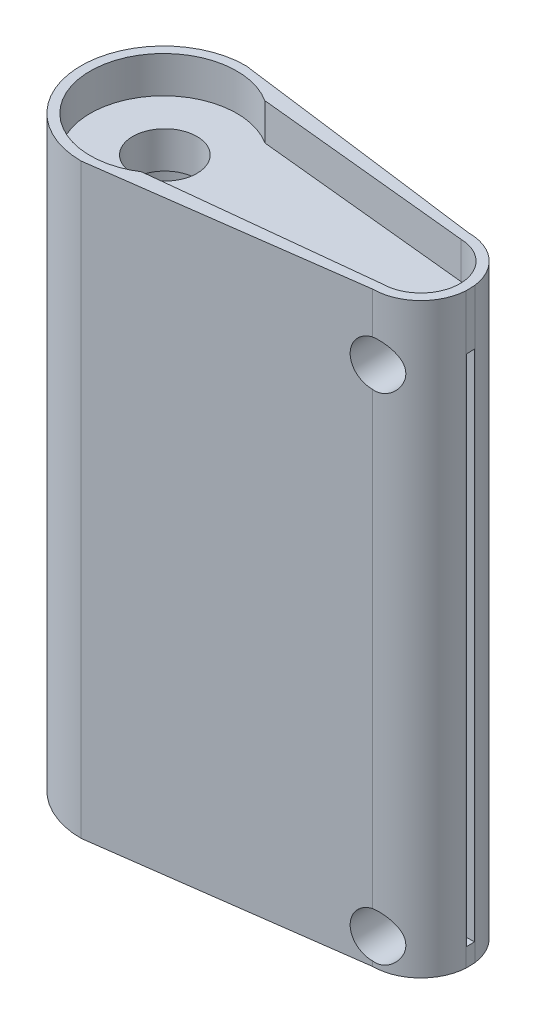
ISO-10303-21;
HEADER;
FILE_DESCRIPTION(('STEP AP214'),'2;1');
FILE_NAME('part.step','',(''),(''),'','','');
FILE_SCHEMA(('AUTOMOTIVE_DESIGN { 1 0 10303 214 1 1 1 1 }'));
ENDSEC;
DATA;
#1=APPLICATION_CONTEXT('core data for automotive mechanical design processes');
#2=APPLICATION_PROTOCOL_DEFINITION('international standard','automotive_design',2000,#1);
#3=PRODUCT_CONTEXT('',#1,'mechanical');
#4=PRODUCT('Part','Part','',(#3));
#5=PRODUCT_RELATED_PRODUCT_CATEGORY('part','',(#4));
#6=PRODUCT_DEFINITION_FORMATION('','',#4);
#7=PRODUCT_DEFINITION_CONTEXT('part definition',#1,'design');
#8=PRODUCT_DEFINITION('design','',#6,#7);
#9=PRODUCT_DEFINITION_SHAPE('','',#8);
#10=(LENGTH_UNIT() NAMED_UNIT(*) SI_UNIT(.MILLI.,.METRE.));
#11=(NAMED_UNIT(*) PLANE_ANGLE_UNIT() SI_UNIT($,.RADIAN.));
#12=(NAMED_UNIT(*) SI_UNIT($,.STERADIAN.) SOLID_ANGLE_UNIT());
#13=UNCERTAINTY_MEASURE_WITH_UNIT(LENGTH_MEASURE(1.E-05),#10,'distance_accuracy_value','');
#14=(GEOMETRIC_REPRESENTATION_CONTEXT(3) GLOBAL_UNCERTAINTY_ASSIGNED_CONTEXT((#13)) GLOBAL_UNIT_ASSIGNED_CONTEXT((#10,
#11,#12)) REPRESENTATION_CONTEXT('',''));
#15=CARTESIAN_POINT('',(0.,0.,0.));
#16=DIRECTION('',(0.,0.,1.));
#17=DIRECTION('',(1.,0.,0.));
#18=AXIS2_PLACEMENT_3D('',#15,#16,#17);
#19=CARTESIAN_POINT('',(-12.9871602464953,32.,0.0358235169116221));
#20=DIRECTION('',(0.,-1.,0.));
#21=DIRECTION('',(0.,0.,-1.));
#22=AXIS2_PLACEMENT_3D('',#19,#20,#21);
#23=CYLINDRICAL_SURFACE('',#22,2.63664714266322);
#24=CARTESIAN_POINT('',(-12.9871602464953,29.75,-2.6008236257516));
#25=CARTESIAN_POINT('',(-12.9536429182694,29.7500016509745,-2.60082700286815));
#26=CARTESIAN_POINT('',(-12.9201440378542,29.7486524852142,-2.600183813309));
#27=CARTESIAN_POINT('',(-12.8534221469592,29.743292727038,-2.59764069467436));
#28=CARTESIAN_POINT('',(-12.8201990228621,29.7392832920886,-2.59574131216172));
#29=CARTESIAN_POINT('',(-12.7216093436019,29.7233797950699,-2.58823932110993));
#30=CARTESIAN_POINT('',(-12.6569604247245,29.7076095651786,-2.58083206617991));
#31=CARTESIAN_POINT('',(-12.5315903290713,29.666468337325,-2.56194306435159));
#32=CARTESIAN_POINT('',(-12.4708641752029,29.6411097964571,-2.55046660534585));
#33=CARTESIAN_POINT('',(-12.3544859230186,29.581675758071,-2.52448714875822));
#34=CARTESIAN_POINT('',(-12.2988391705523,29.5475912170968,-2.50998101417012));
#35=CARTESIAN_POINT('',(-12.1904237204566,29.4692493047555,-2.47823839720175));
#36=CARTESIAN_POINT('',(-12.1380520249355,29.4244894224357,-2.46088795566792));
#37=CARTESIAN_POINT('',(-12.0412539786451,29.3271407394288,-2.42584736966169));
#38=CARTESIAN_POINT('',(-11.9968326567385,29.274547021854,-2.40815701796329));
#39=CARTESIAN_POINT('',(-11.9142840927889,29.1587224927093,-2.37311584238737));
#40=CARTESIAN_POINT('',(-11.8767760831313,29.0950156411206,-2.3558667634034));
#41=CARTESIAN_POINT('',(-11.8133740599787,28.9611776494204,-2.32540093096637));
#42=CARTESIAN_POINT('',(-11.7874694358608,28.8910524494923,-2.31218049710299));
#43=CARTESIAN_POINT('',(-11.7500767473201,28.7517369071863,-2.29268454820715));
#44=CARTESIAN_POINT('',(-11.737666902395,28.6828585516823,-2.28596900858318));
#45=CARTESIAN_POINT('',(-11.7247785826152,28.5436940576085,-2.27899010325594));
#46=CARTESIAN_POINT('',(-11.7242893609858,28.4734092442267,-2.27872092598079));
#47=CARTESIAN_POINT('',(-11.7345831875717,28.3424318956384,-2.28430113946078));
#48=CARTESIAN_POINT('',(-11.7440275609547,28.2815958806547,-2.28942395160812));
#49=CARTESIAN_POINT('',(-11.7716810613146,28.1624954941281,-2.30399710558127));
#50=CARTESIAN_POINT('',(-11.7898927531319,28.1042318805785,-2.31344871373788));
#51=CARTESIAN_POINT('',(-11.8350250767983,27.9898467784687,-2.33591474049053));
#52=CARTESIAN_POINT('',(-11.8621913493797,27.9338425564836,-2.34902783706334));
#53=CARTESIAN_POINT('',(-11.924219313174,27.8268442525601,-2.37731253972362));
#54=CARTESIAN_POINT('',(-11.9590846308119,27.7758525480428,-2.39248511457009));
#55=CARTESIAN_POINT('',(-12.0407389220958,27.6733599216918,-2.42555316379225));
#56=CARTESIAN_POINT('',(-12.0884884633449,27.6226532977567,-2.4435463196136));
#57=CARTESIAN_POINT('',(-12.1918468590331,27.5295523040197,-2.47860749100784));
#58=CARTESIAN_POINT('',(-12.2474604235406,27.4871629523496,-2.49567494360285));
#59=CARTESIAN_POINT('',(-12.368512649667,27.409829012891,-2.52802242908061));
#60=CARTESIAN_POINT('',(-12.4343120042545,27.375386663792,-2.54316321842384));
#61=CARTESIAN_POINT('',(-12.5716361647648,27.3183338544837,-2.56880699286476));
#62=CARTESIAN_POINT('',(-12.6431501810552,27.295701677383,-2.57931848485457));
#63=CARTESIAN_POINT('',(-12.7606238749456,27.2697883627634,-2.59145232177663));
#64=CARTESIAN_POINT('',(-12.8055204727648,27.2623947943366,-2.5949458066474));
#65=CARTESIAN_POINT('',(-12.8959853192472,27.2524940236076,-2.59963966265786));
#66=CARTESIAN_POINT('',(-12.9415538538667,27.2499889659429,-2.60083902734005));
#67=CARTESIAN_POINT('',(-12.9871602464953,27.25,-2.6008236257516));
#68=B_SPLINE_CURVE_WITH_KNOTS('',3,(#24,#25,#26,#27,#28,#29,#30,#31,#32,#33,#34,#35,#36,#37,#38,
#39,#40,#41,#42,#43,#44,#45,#46,#47,#48,#49,#50,#51,#52,#53,#54,#55,#56,#57,#58,#59,#60,#61,#62,
#63,#64,#65,#66,#67),.UNSPECIFIED.,.F.,.F.,(4,2,2,2,2,2,2,2,2,2,2,2,2,2,2,2,2,2,2,2,2,4),(0.,
0.100483374050645,0.200923057058032,0.400731245594896,0.600280731174771,0.800037869107766,
1.01227482136819,1.22464554938224,1.45121252624221,1.67757189565538,1.88724887982661,
2.0967368273421,2.28121679021164,2.46575075470702,2.65583923061658,2.84601743422461,
3.06089994616391,3.27591170903882,3.50211297352299,3.72789681359177,3.86450282961939,
4.00116876257929),.UNSPECIFIED.);
#69=CARTESIAN_POINT('',(-12.9871602464953,29.75,-2.6008236257516));
#70=VERTEX_POINT('',#69);
#71=CARTESIAN_POINT('',(-12.9871602464953,27.25,-2.6008236257516));
#72=VERTEX_POINT('',#71);
#73=EDGE_CURVE('E77',#70,#72,#68,.T.);
#74=ORIENTED_EDGE('',*,*,#73,.F.);
#75=DIRECTION('',(0.,-1.,0.));
#76=VECTOR('',#75,1.);
#77=CARTESIAN_POINT('',(-12.9871602464953,32.,-2.6008236257516));
#78=LINE('',#77,#76);
#79=CARTESIAN_POINT('',(-12.9871602464953,32.,-2.6008236257516));
#80=VERTEX_POINT('',#79);
#81=EDGE_CURVE('E335',#80,#70,#78,.T.);
#82=ORIENTED_EDGE('',*,*,#81,.F.);
#83=CARTESIAN_POINT('',(-12.9871602464953,32.,0.0358235169116221));
#84=DIRECTION('',(0.,1.,0.));
#85=DIRECTION('',(0.,0.,1.));
#86=AXIS2_PLACEMENT_3D('',#83,#84,#85);
#87=CIRCLE('',#86,2.63664714266322);
#88=CARTESIAN_POINT('',(-10.3719870743321,32.,-0.300000000001854));
#89=VERTEX_POINT('',#88);
#90=EDGE_CURVE('E276',#89,#80,#87,.T.);
#91=ORIENTED_EDGE('',*,*,#90,.F.);
#92=DIRECTION('',(0.,-1.,0.));
#93=VECTOR('',#92,1.);
#94=CARTESIAN_POINT('',(-10.3719870743321,32.,-0.300000000001854));
#95=LINE('',#94,#93);
#96=CARTESIAN_POINT('',(-10.3719870743321,0.,-0.300000000001854));
#97=VERTEX_POINT('',#96);
#98=EDGE_CURVE('E314',#89,#97,#95,.T.);
#99=ORIENTED_EDGE('',*,*,#98,.T.);
#100=CARTESIAN_POINT('',(-12.9871602464953,0.,0.0358235169116221));
#101=DIRECTION('',(0.,1.,0.));
#102=DIRECTION('',(0.,0.,1.));
#103=AXIS2_PLACEMENT_3D('',#100,#101,#102);
#104=CIRCLE('',#103,2.63664714266322);
#105=CARTESIAN_POINT('',(-12.9871602464953,0.,-2.6008236257516));
#106=VERTEX_POINT('',#105);
#107=EDGE_CURVE('E295',#97,#106,#104,.T.);
#108=ORIENTED_EDGE('',*,*,#107,.T.);
#109=CARTESIAN_POINT('',(-12.9871602464953,0.25,-2.6008236257516));
#110=VERTEX_POINT('',#109);
#111=EDGE_CURVE('E334',#110,#106,#78,.T.);
#112=ORIENTED_EDGE('',*,*,#111,.F.);
#113=CARTESIAN_POINT('',(-12.9871602464953,2.75,-2.6008236257516));
#114=CARTESIAN_POINT('',(-12.9536429182694,2.75000165097446,-2.60082700286815));
#115=CARTESIAN_POINT('',(-12.9201440378542,2.7486524852142,-2.600183813309));
#116=CARTESIAN_POINT('',(-12.8534221469592,2.74329272703803,-2.59764069467436));
#117=CARTESIAN_POINT('',(-12.8201990228621,2.73928329208861,-2.59574131216172));
#118=CARTESIAN_POINT('',(-12.7216093436019,2.72337979506986,-2.58823932110993));
#119=CARTESIAN_POINT('',(-12.6569604247245,2.70760956517856,-2.58083206617991));
#120=CARTESIAN_POINT('',(-12.5315903290713,2.66646833732504,-2.56194306435159));
#121=CARTESIAN_POINT('',(-12.4708641752029,2.6411097964571,-2.55046660534585));
#122=CARTESIAN_POINT('',(-12.3544859230186,2.58167575807096,-2.52448714875822));
#123=CARTESIAN_POINT('',(-12.2988391705523,2.54759121709681,-2.50998101417012));
#124=CARTESIAN_POINT('',(-12.1904237204566,2.46924930475551,-2.47823839720176));
#125=CARTESIAN_POINT('',(-12.1380520249355,2.42448942243572,-2.46088795566792));
#126=CARTESIAN_POINT('',(-12.0412539786451,2.32714073942883,-2.42584736966169));
#127=CARTESIAN_POINT('',(-11.9968326567385,2.27454702185398,-2.40815701796329));
#128=CARTESIAN_POINT('',(-11.9142840927889,2.1587224927093,-2.37311584238737));
#129=CARTESIAN_POINT('',(-11.8767760831313,2.0950156411206,-2.3558667634034));
#130=CARTESIAN_POINT('',(-11.8133740599787,1.96117764942043,-2.32540093096637));
#131=CARTESIAN_POINT('',(-11.7874694358608,1.89105244949229,-2.31218049710299));
#132=CARTESIAN_POINT('',(-11.7500767473201,1.75173690718627,-2.29268454820715));
#133=CARTESIAN_POINT('',(-11.737666902395,1.68285855168228,-2.28596900858318));
#134=CARTESIAN_POINT('',(-11.7247785826152,1.54369405760852,-2.27899010325594));
#135=CARTESIAN_POINT('',(-11.7242893609858,1.47340924422668,-2.27872092598079));
#136=CARTESIAN_POINT('',(-11.7345831875717,1.3424318956384,-2.28430113946079));
#137=CARTESIAN_POINT('',(-11.7440275609547,1.28159588065472,-2.28942395160812));
#138=CARTESIAN_POINT('',(-11.7716810613146,1.16249549412808,-2.30399710558127));
#139=CARTESIAN_POINT('',(-11.7898927531319,1.10423188057851,-2.31344871373789));
#140=CARTESIAN_POINT('',(-11.8350250767983,0.989846778468667,-2.33591474049053));
#141=CARTESIAN_POINT('',(-11.8621913493797,0.933842556483624,-2.34902783706335));
#142=CARTESIAN_POINT('',(-11.924219313174,0.826844252560114,-2.37731253972362));
#143=CARTESIAN_POINT('',(-11.9590846308119,0.77585254804275,-2.3924851145701));
#144=CARTESIAN_POINT('',(-12.0407389220958,0.673359921691824,-2.42555316379225));
#145=CARTESIAN_POINT('',(-12.088488463345,0.622653297756652,-2.4435463196136));
#146=CARTESIAN_POINT('',(-12.1918468590331,0.52955230401966,-2.47860749100784));
#147=CARTESIAN_POINT('',(-12.2474604235406,0.487162952349585,-2.49567494360286));
#148=CARTESIAN_POINT('',(-12.368512649667,0.409829012891001,-2.52802242908061));
#149=CARTESIAN_POINT('',(-12.4343120042545,0.375386663791952,-2.54316321842384));
#150=CARTESIAN_POINT('',(-12.5716361647648,0.318333854483672,-2.56880699286476));
#151=CARTESIAN_POINT('',(-12.6431501810552,0.295701677382958,-2.57931848485457));
#152=CARTESIAN_POINT('',(-12.7606238749456,0.269788362763451,-2.59145232177663));
#153=CARTESIAN_POINT('',(-12.8055204727648,0.262394794336616,-2.5949458066474));
#154=CARTESIAN_POINT('',(-12.8959853192472,0.252494023607655,-2.59963966265786));
#155=CARTESIAN_POINT('',(-12.9415538538667,0.249988965942941,-2.60083902734005));
#156=CARTESIAN_POINT('',(-12.9871602464953,0.250000000000002,-2.6008236257516));
#157=B_SPLINE_CURVE_WITH_KNOTS('',3,(#113,#114,#115,#116,#117,#118,#119,#120,#121,#122,#123,
#124,#125,#126,#127,#128,#129,#130,#131,#132,#133,#134,#135,#136,#137,#138,#139,#140,#141,#142,
#143,#144,#145,#146,#147,#148,#149,#150,#151,#152,#153,#154,#155,#156),.UNSPECIFIED.,.F.,.F.,(4,
2,2,2,2,2,2,2,2,2,2,2,2,2,2,2,2,2,2,2,2,4),(0.,0.100483374050643,0.200923057058032,
0.400731245594897,0.600280731174771,0.800037869107767,1.01227482136819,1.22464554938224,
1.45121252624221,1.67757189565538,1.88724887982661,2.09673682734209,2.28121679021164,
2.46575075470702,2.65583923061658,2.84601743422462,3.06089994616391,3.27591170903883,
3.50211297352298,3.72789681359177,3.86450282961938,4.00116876257927),.UNSPECIFIED.);
#158=CARTESIAN_POINT('',(-12.9871602464953,2.75,-2.6008236257516));
#159=VERTEX_POINT('',#158);
#160=EDGE_CURVE('E70',#159,#110,#157,.T.);
#161=ORIENTED_EDGE('',*,*,#160,.F.);
#162=EDGE_CURVE('E340',#72,#159,#78,.T.);
#163=ORIENTED_EDGE('',*,*,#162,.F.);
#164=EDGE_LOOP('',(#74,#82,#91,#99,#108,#112,#161,#163));
#165=FACE_BOUND('',#164,.T.);
#166=ADVANCED_FACE('F54',(#165),#23,.T.);
#167=CARTESIAN_POINT('',(-23.3495000105712,29.,0.599950037503474));
#168=DIRECTION('',(0.,1.,0.));
#169=DIRECTION('',(0.,0.,1.));
#170=AXIS2_PLACEMENT_3D('',#167,#168,#169);
#171=PLANE('',#170);
#172=DIRECTION('',(0.0326977190779221,0.,0.999465286624354));
#173=VECTOR('',#172,1.);
#174=CARTESIAN_POINT('',(-14.211689062653,29.,-4.9933489360173));
#175=LINE('',#174,#173);
#176=CARTESIAN_POINT('',(-14.038668343629,29.,0.295344202461677));
#177=VERTEX_POINT('',#176);
#178=CARTESIAN_POINT('',(-14.053382317214,29.,-0.154415176519281));
#179=VERTEX_POINT('',#178);
#180=EDGE_CURVE('E203',#177,#179,#175,.F.);
#181=ORIENTED_EDGE('',*,*,#180,.F.);
#182=DIRECTION('',(0.999465286624354,0.,-0.0326977190779221));
#183=VECTOR('',#182,1.);
#184=CARTESIAN_POINT('',(-23.3495000105712,29.,0.599950037503474));
#185=LINE('',#184,#183);
#186=CARTESIAN_POINT('',(-23.3495000105712,29.,0.599950037503474));
#187=VERTEX_POINT('',#186);
#188=EDGE_CURVE('E208',#187,#177,#185,.T.);
#189=ORIENTED_EDGE('',*,*,#188,.F.);
#190=DIRECTION('',(0.0326977190779212,0.,0.999465286624354));
#191=VECTOR('',#190,1.);
#192=CARTESIAN_POINT('',(-23.3495000105712,29.,0.599950037503474));
#193=LINE('',#192,#191);
#194=CARTESIAN_POINT('',(-23.3642139841563,29.,0.150190658522515));
#195=VERTEX_POINT('',#194);
#196=EDGE_CURVE('E696',#195,#187,#193,.T.);
#197=ORIENTED_EDGE('',*,*,#196,.F.);
#198=DIRECTION('',(0.999465286624354,0.,-0.0326977190779221));
#199=VECTOR('',#198,1.);
#200=CARTESIAN_POINT('',(-23.3642139841563,29.,0.150190658522515));
#201=LINE('',#200,#199);
#202=EDGE_CURVE('E210',#195,#179,#201,.T.);
#203=ORIENTED_EDGE('',*,*,#202,.T.);
#204=EDGE_LOOP('',(#181,#189,#197,#203));
#205=FACE_BOUND('',#204,.T.);
#206=ADVANCED_FACE('F205',(#205),#171,.F.);
#207=DIRECTION('',(0.0326977190779221,0.,0.999465286624354));
#208=VECTOR('',#207,1.);
#209=CARTESIAN_POINT('',(-11.9216263974346,29.,-5.06826882238079));
#210=LINE('',#209,#208);
#211=CARTESIAN_POINT('',(-11.7633196519956,29.,-0.229335062882771));
#212=VERTEX_POINT('',#211);
#213=CARTESIAN_POINT('',(-11.7486056784105,29.,0.220424316098187));
#214=VERTEX_POINT('',#213);
#215=EDGE_CURVE('E215',#212,#214,#210,.T.);
#216=ORIENTED_EDGE('',*,*,#215,.F.);
#217=CARTESIAN_POINT('',(-10.3711652580397,29.,-0.274879689490473));
#218=VERTEX_POINT('',#217);
#219=EDGE_CURVE('E247',#212,#218,#201,.T.);
#220=ORIENTED_EDGE('',*,*,#219,.T.);
#221=DIRECTION('',(0.0326977190779212,0.,0.999465286624354));
#222=VECTOR('',#221,1.);
#223=CARTESIAN_POINT('',(-10.3564512844547,29.,0.174879689490487));
#224=LINE('',#223,#222);
#225=CARTESIAN_POINT('',(-10.3564512844547,29.,0.174879689490487));
#226=VERTEX_POINT('',#225);
#227=EDGE_CURVE('E243',#218,#226,#224,.T.);
#228=ORIENTED_EDGE('',*,*,#227,.T.);
#229=EDGE_CURVE('E234',#214,#226,#185,.T.);
#230=ORIENTED_EDGE('',*,*,#229,.F.);
#231=EDGE_LOOP('',(#216,#220,#228,#230));
#232=FACE_BOUND('',#231,.T.);
#233=ADVANCED_FACE('F406',(#232),#171,.F.);
#234=CARTESIAN_POINT('',(-23.3642139841563,1.,0.150190658522512));
#235=DIRECTION('',(0.,-1.,0.));
#236=DIRECTION('',(0.,0.,-1.));
#237=AXIS2_PLACEMENT_3D('',#234,#235,#236);
#238=PLANE('',#237);
#239=DIRECTION('',(0.0326977190779221,0.,0.999465286624354));
#240=VECTOR('',#239,1.);
#241=CARTESIAN_POINT('',(-11.9216263974346,1.,-5.0682688223808));
#242=LINE('',#241,#240);
#243=CARTESIAN_POINT('',(-11.7486056784105,1.,0.220424316098184));
#244=VERTEX_POINT('',#243);
#245=CARTESIAN_POINT('',(-11.7633196519956,1.,-0.229335062882775));
#246=VERTEX_POINT('',#245);
#247=EDGE_CURVE('E724',#244,#246,#242,.F.);
#248=ORIENTED_EDGE('',*,*,#247,.F.);
#249=DIRECTION('',(0.999465286624354,0.,-0.0326977190779221));
#250=VECTOR('',#249,1.);
#251=CARTESIAN_POINT('',(-23.3495000105712,1.,0.599950037503471));
#252=LINE('',#251,#250);
#253=CARTESIAN_POINT('',(-10.3564512844547,0.999999999999997,0.174879689490384));
#254=VERTEX_POINT('',#253);
#255=EDGE_CURVE('E257',#244,#254,#252,.T.);
#256=ORIENTED_EDGE('',*,*,#255,.T.);
#257=DIRECTION('',(-0.032697719077925,0.,-0.999465286624353));
#258=VECTOR('',#257,1.);
#259=CARTESIAN_POINT('',(-10.3711652580397,1.,-0.274879689490476));
#260=LINE('',#259,#258);
#261=CARTESIAN_POINT('',(-10.3711652580397,1.,-0.274879689490476));
#262=VERTEX_POINT('',#261);
#263=EDGE_CURVE('E702',#254,#262,#260,.T.);
#264=ORIENTED_EDGE('',*,*,#263,.T.);
#265=DIRECTION('',(0.999465286624354,0.,-0.0326977190779221));
#266=VECTOR('',#265,1.);
#267=CARTESIAN_POINT('',(-23.3642139841563,1.,0.150190658522512));
#268=LINE('',#267,#266);
#269=EDGE_CURVE('E252',#246,#262,#268,.T.);
#270=ORIENTED_EDGE('',*,*,#269,.F.);
#271=EDGE_LOOP('',(#248,#256,#264,#270));
#272=FACE_BOUND('',#271,.T.);
#273=ADVANCED_FACE('F588',(#272),#238,.F.);
#274=DIRECTION('',(0.0326977190779221,0.,0.999465286624354));
#275=VECTOR('',#274,1.);
#276=CARTESIAN_POINT('',(-14.211689062653,1.,-4.99334893601731));
#277=LINE('',#276,#275);
#278=CARTESIAN_POINT('',(-14.053382317214,1.,-0.154415176519285));
#279=VERTEX_POINT('',#278);
#280=CARTESIAN_POINT('',(-14.038668343629,1.,0.295344202461674));
#281=VERTEX_POINT('',#280);
#282=EDGE_CURVE('E730',#279,#281,#277,.T.);
#283=ORIENTED_EDGE('',*,*,#282,.F.);
#284=CARTESIAN_POINT('',(-23.3642139841563,1.,0.150190658522512));
#285=VERTEX_POINT('',#284);
#286=EDGE_CURVE('E248',#285,#279,#268,.T.);
#287=ORIENTED_EDGE('',*,*,#286,.F.);
#288=DIRECTION('',(-0.032697719077925,0.,-0.999465286624353));
#289=VECTOR('',#288,1.);
#290=CARTESIAN_POINT('',(-23.3642139841563,1.,0.150190658522512));
#291=LINE('',#290,#289);
#292=CARTESIAN_POINT('',(-23.3495000105712,1.,0.599950037503471));
#293=VERTEX_POINT('',#292);
#294=EDGE_CURVE('E688',#293,#285,#291,.T.);
#295=ORIENTED_EDGE('',*,*,#294,.F.);
#296=EDGE_CURVE('E253',#293,#281,#252,.T.);
#297=ORIENTED_EDGE('',*,*,#296,.T.);
#298=EDGE_LOOP('',(#283,#287,#295,#297));
#299=FACE_BOUND('',#298,.T.);
#300=ADVANCED_FACE('F504',(#299),#238,.F.);
#301=CARTESIAN_POINT('',(-26.9871144134073,30.,0.));
#302=DIRECTION('',(0.,-1.,0.));
#303=DIRECTION('',(0.,0.,-1.));
#304=AXIS2_PLACEMENT_3D('',#301,#302,#303);
#305=CYLINDRICAL_SURFACE('',#304,1.75);
#306=CARTESIAN_POINT('',(-26.9871144134073,30.,0.));
#307=DIRECTION('',(0.,1.,0.));
#308=DIRECTION('',(0.,0.,1.));
#309=AXIS2_PLACEMENT_3D('',#306,#307,#308);
#310=CIRCLE('',#309,1.75);
#311=CARTESIAN_POINT('',(-26.9871144134073,30.,1.75));
#312=VERTEX_POINT('',#311);
#313=EDGE_CURVE('E339',#312,#312,#310,.T.);
#314=ORIENTED_EDGE('',*,*,#313,.T.);
#315=EDGE_LOOP('',(#314));
#316=FACE_BOUND('',#315,.T.);
#317=CARTESIAN_POINT('',(-26.9871144134073,28.,0.));
#318=DIRECTION('',(0.,-1.,0.));
#319=DIRECTION('',(0.,0.,-1.));
#320=AXIS2_PLACEMENT_3D('',#317,#318,#319);
#321=CIRCLE('',#320,1.75);
#322=CARTESIAN_POINT('',(-26.9871144134073,28.,-1.75));
#323=VERTEX_POINT('',#322);
#324=EDGE_CURVE('E58',#323,#323,#321,.T.);
#325=ORIENTED_EDGE('',*,*,#324,.T.);
#326=EDGE_LOOP('',(#325));
#327=FACE_BOUND('',#326,.T.);
#328=ADVANCED_FACE('F56',(#316,#327),#305,.F.);
#329=CARTESIAN_POINT('',(0.,30.,0.));
#330=DIRECTION('',(0.,1.,0.));
#331=DIRECTION('',(0.,0.,1.));
#332=AXIS2_PLACEMENT_3D('',#329,#330,#331);
#333=PLANE('',#332);
#334=ORIENTED_EDGE('',*,*,#313,.F.);
#335=EDGE_LOOP('',(#334));
#336=FACE_BOUND('',#335,.T.);
#337=CARTESIAN_POINT('',(-26.9871144111105,30.,0.0716479314063977));
#338=DIRECTION('',(0.,1.,0.));
#339=DIRECTION('',(0.,0.,1.));
#340=AXIS2_PLACEMENT_3D('',#337,#338,#339);
#341=CIRCLE('',#340,4.00017684495756);
#342=CARTESIAN_POINT('',(-24.8217817734605,30.,-3.29179514961377));
#343=VERTEX_POINT('',#342);
#344=CARTESIAN_POINT('',(-24.8217479106025,30.,3.43506921180117));
#345=VERTEX_POINT('',#344);
#346=EDGE_CURVE('E357',#343,#345,#341,.T.);
#347=ORIENTED_EDGE('',*,*,#346,.T.);
#348=DIRECTION('',(-0.994303481764952,0.,0.10658605044796));
#349=VECTOR('',#348,1.);
#350=CARTESIAN_POINT('',(0.0820551859234197,30.,0.765463742371819));
#351=LINE('',#350,#349);
#352=CARTESIAN_POINT('',(-12.9871602464953,30.,2.16644048734145));
#353=VERTEX_POINT('',#352);
#354=EDGE_CURVE('E361',#353,#345,#351,.T.);
#355=ORIENTED_EDGE('',*,*,#354,.F.);
#356=CARTESIAN_POINT('',(-12.9871602464953,30.,0.0358235169116221));
#357=DIRECTION('',(0.,1.,0.));
#358=DIRECTION('',(0.,0.,1.));
#359=AXIS2_PLACEMENT_3D('',#356,#357,#358);
#360=CIRCLE('',#359,2.13061697043081);
#361=CARTESIAN_POINT('',(-12.9397621783685,30.,-2.09426617552422));
#362=VERTEX_POINT('',#361);
#363=EDGE_CURVE('E64',#353,#362,#360,.T.);
#364=ORIENTED_EDGE('',*,*,#363,.T.);
#365=DIRECTION('',(0.994959561797014,0.,0.100276968386042));
#366=VECTOR('',#365,1.);
#367=CARTESIAN_POINT('',(0.0788327420462111,30.,-0.782187492741088));
#368=LINE('',#367,#366);
#369=EDGE_CURVE('E12',#343,#362,#368,.T.);
#370=ORIENTED_EDGE('',*,*,#369,.F.);
#371=EDGE_LOOP('',(#347,#355,#364,#370));
#372=FACE_BOUND('',#371,.T.);
#373=ADVANCED_FACE('F370',(#336,#372),#333,.T.);
#374=CARTESIAN_POINT('',(0.,0.,0.));
#375=DIRECTION('',(0.,1.,0.));
#376=DIRECTION('',(0.,0.,1.));
#377=AXIS2_PLACEMENT_3D('',#374,#375,#376);
#378=PLANE('',#377);
#379=CARTESIAN_POINT('',(-26.9871144134073,0.,0.));
#380=DIRECTION('',(0.,-1.,0.));
#381=DIRECTION('',(0.,0.,-1.));
#382=AXIS2_PLACEMENT_3D('',#379,#380,#381);
#383=CIRCLE('',#382,3.);
#384=CARTESIAN_POINT('',(-26.9871144134073,0.,-3.));
#385=VERTEX_POINT('',#384);
#386=EDGE_CURVE('E233',#385,#385,#383,.T.);
#387=ORIENTED_EDGE('',*,*,#386,.F.);
#388=EDGE_LOOP('',(#387));
#389=FACE_BOUND('',#388,.T.);
#390=ORIENTED_EDGE('',*,*,#107,.F.);
#391=DIRECTION('',(0.0326977190779221,0.,0.999465286624354));
#392=VECTOR('',#391,1.);
#393=CARTESIAN_POINT('',(-10.3510938888815,0.,0.338638234521349));
#394=LINE('',#393,#392);
#395=CARTESIAN_POINT('',(-10.3556294681622,0.,0.200000000001868));
#396=VERTEX_POINT('',#395);
#397=EDGE_CURVE('E265',#97,#396,#394,.T.);
#398=ORIENTED_EDGE('',*,*,#397,.T.);
#399=CARTESIAN_POINT('',(-12.9871602464953,0.,2.67247065957485));
#400=VERTEX_POINT('',#399);
#401=EDGE_CURVE('E300',#400,#396,#104,.T.);
#402=ORIENTED_EDGE('',*,*,#401,.F.);
#403=DIRECTION('',(0.990925381502443,0.,-0.134413125453722));
#404=VECTOR('',#403,1.);
#405=CARTESIAN_POINT('',(0.121317820304093,0.,0.894383691786624));
#406=LINE('',#405,#404);
#407=CARTESIAN_POINT('',(-26.9871144111105,0.,4.5714810498644));
#408=VERTEX_POINT('',#407);
#409=EDGE_CURVE('E307',#408,#400,#406,.T.);
#410=ORIENTED_EDGE('',*,*,#409,.F.);
#411=CARTESIAN_POINT('',(-26.9871144111105,0.,0.0716479314063977));
#412=DIRECTION('',(0.,1.,0.));
#413=DIRECTION('',(0.,0.,1.));
#414=AXIS2_PLACEMENT_3D('',#411,#412,#413);
#415=CIRCLE('',#414,4.499833118458);
#416=CARTESIAN_POINT('',(-26.9871144111105,0.,-4.4281851870516));
#417=VERTEX_POINT('',#416);
#418=EDGE_CURVE('E304',#417,#408,#415,.T.);
#419=ORIENTED_EDGE('',*,*,#418,.F.);
#420=DIRECTION('',(0.991588774499467,0.,0.129428367395423));
#421=VECTOR('',#420,1.);
#422=CARTESIAN_POINT('',(0.116231924045835,0.,-0.890486942249725));
#423=LINE('',#422,#421);
#424=EDGE_CURVE('E299',#417,#106,#423,.T.);
#425=ORIENTED_EDGE('',*,*,#424,.T.);
#426=EDGE_LOOP('',(#390,#398,#402,#410,#419,#425));
#427=FACE_BOUND('',#426,.T.);
#428=ADVANCED_FACE('F440',(#389,#427),#378,.F.);
#429=CARTESIAN_POINT('',(0.116231924045835,32.,-0.890486942249725));
#430=DIRECTION('',(0.129428367395423,0.,-0.991588774499467));
#431=DIRECTION('',(-0.991588774499467,0.,-0.129428367395423));
#432=AXIS2_PLACEMENT_3D('',#429,#430,#431);
#433=PLANE('',#432);
#434=ORIENTED_EDGE('',*,*,#81,.T.);
#435=CARTESIAN_POINT('',(-12.9871602464953,28.5,-2.6008236257516));
#436=DIRECTION('',(0.129428367395423,0.,-0.991588774499467));
#437=DIRECTION('',(0.991588774499467,0.,0.129428367395423));
#438=AXIS2_PLACEMENT_3D('',#435,#436,#437);
#439=ELLIPSE('',#438,1.26668663774845,1.25);
#440=EDGE_CURVE('E214',#70,#72,#439,.F.);
#441=ORIENTED_EDGE('',*,*,#440,.T.);
#442=ORIENTED_EDGE('',*,*,#162,.T.);
#443=CARTESIAN_POINT('',(-12.9871602464953,1.5,-2.6008236257516));
#444=DIRECTION('',(0.129428367395423,0.,-0.991588774499467));
#445=DIRECTION('',(0.991588774499467,0.,0.129428367395423));
#446=AXIS2_PLACEMENT_3D('',#443,#444,#445);
#447=ELLIPSE('',#446,1.26668663774845,1.25);
#448=EDGE_CURVE('E726',#159,#110,#447,.F.);
#449=ORIENTED_EDGE('',*,*,#448,.T.);
#450=ORIENTED_EDGE('',*,*,#111,.T.);
#451=ORIENTED_EDGE('',*,*,#424,.F.);
#452=DIRECTION('',(0.,-1.,0.));
#453=VECTOR('',#452,1.);
#454=CARTESIAN_POINT('',(-26.9871144111105,32.,-4.4281851870516));
#455=LINE('',#454,#453);
#456=CARTESIAN_POINT('',(-26.9871144111105,32.,-4.4281851870516));
#457=VERTEX_POINT('',#456);
#458=EDGE_CURVE('E331',#457,#417,#455,.T.);
#459=ORIENTED_EDGE('',*,*,#458,.F.);
#460=DIRECTION('',(0.991588774499467,0.,0.129428367395423));
#461=VECTOR('',#460,1.);
#462=CARTESIAN_POINT('',(0.116231924045835,32.,-0.890486942249725));
#463=LINE('',#462,#461);
#464=EDGE_CURVE('E279',#457,#80,#463,.T.);
#465=ORIENTED_EDGE('',*,*,#464,.T.);
#466=EDGE_LOOP('',(#434,#441,#442,#449,#450,#451,#459,#465));
#467=FACE_BOUND('',#466,.T.);
#468=ADVANCED_FACE('F461',(#467),#433,.T.);
#469=CARTESIAN_POINT('',(-26.9871144111105,32.,0.0716479314063977));
#470=DIRECTION('',(0.,-1.,0.));
#471=DIRECTION('',(0.,0.,-1.));
#472=AXIS2_PLACEMENT_3D('',#469,#470,#471);
#473=CYLINDRICAL_SURFACE('',#472,4.499833118458);
#474=ORIENTED_EDGE('',*,*,#418,.T.);
#475=DIRECTION('',(0.,-1.,0.));
#476=VECTOR('',#475,1.);
#477=CARTESIAN_POINT('',(-26.9871144111105,32.,4.5714810498644));
#478=LINE('',#477,#476);
#479=CARTESIAN_POINT('',(-26.9871144111105,32.,4.5714810498644));
#480=VERTEX_POINT('',#479);
#481=EDGE_CURVE('E326',#480,#408,#478,.T.);
#482=ORIENTED_EDGE('',*,*,#481,.F.);
#483=CARTESIAN_POINT('',(-26.9871144111105,32.,0.0716479314063977));
#484=DIRECTION('',(0.,1.,0.));
#485=DIRECTION('',(0.,0.,1.));
#486=AXIS2_PLACEMENT_3D('',#483,#484,#485);
#487=CIRCLE('',#486,4.499833118458);
#488=EDGE_CURVE('E284',#457,#480,#487,.T.);
#489=ORIENTED_EDGE('',*,*,#488,.F.);
#490=ORIENTED_EDGE('',*,*,#458,.T.);
#491=EDGE_LOOP('',(#474,#482,#489,#490));
#492=FACE_BOUND('',#491,.T.);
#493=ADVANCED_FACE('F418',(#492),#473,.T.);
#494=CARTESIAN_POINT('',(0.121317820304093,32.,0.894383691786624));
#495=DIRECTION('',(-0.134413125453722,0.,-0.990925381502443));
#496=DIRECTION('',(-0.990925381502443,0.,0.134413125453722));
#497=AXIS2_PLACEMENT_3D('',#494,#495,#496);
#498=PLANE('',#497);
#499=DIRECTION('',(0.,-1.,0.));
#500=VECTOR('',#499,1.);
#501=CARTESIAN_POINT('',(-12.9871602464953,32.,2.67247065957485));
#502=LINE('',#501,#500);
#503=CARTESIAN_POINT('',(-12.9871602464953,0.261949223779536,2.67247065957485));
#504=VERTEX_POINT('',#503);
#505=EDGE_CURVE('E321',#504,#400,#502,.T.);
#506=ORIENTED_EDGE('',*,*,#505,.F.);
#507=CARTESIAN_POINT('',(-12.8154054872093,1.5,2.64917314955227));
#508=DIRECTION('',(-0.134413125453722,0.,-0.990925381502443));
#509=DIRECTION('',(0.990925381502443,0.,-0.134413125453722));
#510=AXIS2_PLACEMENT_3D('',#507,#508,#509);
#511=ELLIPSE('',#510,1.25654594713167,1.25);
#512=CARTESIAN_POINT('',(-12.9871602464953,2.73805077622045,2.67247065957485));
#513=VERTEX_POINT('',#512);
#514=EDGE_CURVE('E681',#504,#513,#511,.T.);
#515=ORIENTED_EDGE('',*,*,#514,.T.);
#516=CARTESIAN_POINT('',(-12.9871602464953,27.2619492237795,2.67247065957485));
#517=VERTEX_POINT('',#516);
#518=EDGE_CURVE('E327',#517,#513,#502,.T.);
#519=ORIENTED_EDGE('',*,*,#518,.F.);
#520=CARTESIAN_POINT('',(-12.8154054872093,28.5,2.64917314955227));
#521=DIRECTION('',(-0.134413125453722,0.,-0.990925381502443));
#522=DIRECTION('',(0.990925381502443,0.,-0.134413125453722));
#523=AXIS2_PLACEMENT_3D('',#520,#521,#522);
#524=ELLIPSE('',#523,1.25654594713167,1.25);
#525=CARTESIAN_POINT('',(-12.9871602464953,29.7380507762205,2.67247065957485));
#526=VERTEX_POINT('',#525);
#527=EDGE_CURVE('E680',#517,#526,#524,.T.);
#528=ORIENTED_EDGE('',*,*,#527,.T.);
#529=CARTESIAN_POINT('',(-12.9871602464953,32.,2.67247065957485));
#530=VERTEX_POINT('',#529);
#531=EDGE_CURVE('E322',#530,#526,#502,.T.);
#532=ORIENTED_EDGE('',*,*,#531,.F.);
#533=DIRECTION('',(0.990925381502443,0.,-0.134413125453722));
#534=VECTOR('',#533,1.);
#535=CARTESIAN_POINT('',(0.121317820304093,32.,0.894383691786624));
#536=LINE('',#535,#534);
#537=EDGE_CURVE('E287',#480,#530,#536,.T.);
#538=ORIENTED_EDGE('',*,*,#537,.F.);
#539=ORIENTED_EDGE('',*,*,#481,.T.);
#540=ORIENTED_EDGE('',*,*,#409,.T.);
#541=EDGE_LOOP('',(#506,#515,#519,#528,#532,#538,#539,#540));
#542=FACE_BOUND('',#541,.T.);
#543=ADVANCED_FACE('F411',(#542),#498,.F.);
#544=ORIENTED_EDGE('',*,*,#518,.T.);
#545=CARTESIAN_POINT('',(-12.9871602464953,2.73805077622045,2.67247065957485));
#546=CARTESIAN_POINT('',(-12.9548668407339,2.74254725082843,2.67247353048874));
#547=CARTESIAN_POINT('',(-12.9224124858536,2.74577850464229,2.67187660814266));
#548=CARTESIAN_POINT('',(-12.8574015709144,2.74969760292261,2.66947628717643));
#549=CARTESIAN_POINT('',(-12.8248450324187,2.75038595206015,2.66767312803291));
#550=CARTESIAN_POINT('',(-12.7276341213168,2.74862459701355,2.66046599832731));
#551=CARTESIAN_POINT('',(-12.6631345614756,2.74239037158499,2.6532644799426));
#552=CARTESIAN_POINT('',(-12.5365801569062,2.72013997687142,2.63447481800188));
#553=CARTESIAN_POINT('',(-12.4745246814954,2.70412634894675,2.62288781439345));
#554=CARTESIAN_POINT('',(-12.3542975282725,2.66301050674545,2.59613392102538));
#555=CARTESIAN_POINT('',(-12.2961283358893,2.63790254095818,2.58096476793304));
#556=CARTESIAN_POINT('',(-12.1826074162902,2.57824763640406,2.54744652287848));
#557=CARTESIAN_POINT('',(-12.12746838035,2.54335649738435,2.52899270790337));
#558=CARTESIAN_POINT('',(-12.023653454877,2.46558167752151,2.4907427731879));
#559=CARTESIAN_POINT('',(-11.9749815166176,2.42269314853144,2.47094584388572));
#560=CARTESIAN_POINT('',(-11.8806074652979,2.32535526836009,2.4296380461088));
#561=CARTESIAN_POINT('',(-11.835629334661,2.27019398871051,2.40814345439308));
#562=CARTESIAN_POINT('',(-11.7553966384409,2.15239007081631,2.36749548733977));
#563=CARTESIAN_POINT('',(-11.7201440365839,2.08974592532557,2.34834258525757));
#564=CARTESIAN_POINT('',(-11.6604791491874,1.95820052383941,2.31464051914543));
#565=CARTESIAN_POINT('',(-11.6360784790854,1.88929265795444,2.30009629280502));
#566=CARTESIAN_POINT('',(-11.5994171104434,1.74730295538149,2.27782089719553));
#567=CARTESIAN_POINT('',(-11.5871378246397,1.67422769169997,2.2700792985991));
#568=CARTESIAN_POINT('',(-11.5762018134604,1.53592528983016,2.26318420189602));
#569=CARTESIAN_POINT('',(-11.5760306318006,1.4708624026046,2.26307594717691));
#570=CARTESIAN_POINT('',(-11.5855451351222,1.34175548398922,2.26907551166602));
#571=CARTESIAN_POINT('',(-11.5952309958606,1.27771147078721,2.27518344171258));
#572=CARTESIAN_POINT('',(-11.6231516066002,1.15606415081028,2.29228840518377));
#573=CARTESIAN_POINT('',(-11.6408804530132,1.09830076962048,2.30299435077247));
#574=CARTESIAN_POINT('',(-11.6840259650062,0.986580252042442,2.32806467120393));
#575=CARTESIAN_POINT('',(-11.7094448783216,0.932624234205534,2.34243011549017));
#576=CARTESIAN_POINT('',(-11.7702843015936,0.824066770322432,2.37514605419726));
#577=CARTESIAN_POINT('',(-11.8064645339326,0.769969569537104,2.39375443919436));
#578=CARTESIAN_POINT('',(-11.8865695365394,0.668311704924814,2.43219221488124));
#579=CARTESIAN_POINT('',(-11.9304996066858,0.620755554186953,2.4520224350689));
#580=CARTESIAN_POINT('',(-12.0305312041337,0.528238910197647,2.49346574493921));
#581=CARTESIAN_POINT('',(-12.0874369555213,0.484123713640529,2.51503808232958));
#582=CARTESIAN_POINT('',(-12.2087237518237,0.406206384721988,2.55575011368909));
#583=CARTESIAN_POINT('',(-12.273104072114,0.372403253804702,2.57489004309261));
#584=CARTESIAN_POINT('',(-12.406313079401,0.317041963688564,2.60859231122113));
#585=CARTESIAN_POINT('',(-12.4750126357309,0.295230618468192,2.62324614785432));
#586=CARTESIAN_POINT('',(-12.6160161308667,0.263875835923338,2.64719194173169));
#587=CARTESIAN_POINT('',(-12.6883139809429,0.254312360925614,2.65649264301035));
#588=CARTESIAN_POINT('',(-12.7987478877268,0.249529006540554,2.66600451746329));
#589=CARTESIAN_POINT('',(-12.8365512855168,0.249617033517681,2.66843607439511));
#590=CARTESIAN_POINT('',(-12.9120282537124,0.25322016067817,2.67167123115007));
#591=CARTESIAN_POINT('',(-12.9497019133637,0.256732003443882,2.67247637610466));
#592=CARTESIAN_POINT('',(-12.9871602464953,0.261949223779543,2.67247065957485));
#593=B_SPLINE_CURVE_WITH_KNOTS('',3,(#545,#546,#547,#548,#549,#550,#551,#552,#553,#554,#555,
#556,#557,#558,#559,#560,#561,#562,#563,#564,#565,#566,#567,#568,#569,#570,#571,#572,#573,#574,
#575,#576,#577,#578,#579,#580,#581,#582,#583,#584,#585,#586,#587,#588,#589,#590,#591,#592),
.UNSPECIFIED.,.F.,.F.,(4,2,2,2,2,2,2,2,2,2,2,2,2,2,2,2,2,2,2,2,2,2,2,4),(0.,0.0977541951489954,
0.195488988718547,0.390050650455846,0.584561773214628,0.779196125586374,0.981794900407447,
1.18451689553532,1.40654033287083,1.62860856722279,1.85091392507802,2.07287786178297,
2.26702265824982,2.46117091649691,2.64451156640624,2.82790585695391,3.03016004285074,
3.23255308424447,3.45696564540648,3.68135646895845,3.90080741192734,4.1198988697648,
4.23337518980671,4.34674365375062),.UNSPECIFIED.);
#594=EDGE_CURVE('E424',#513,#504,#593,.T.);
#595=ORIENTED_EDGE('',*,*,#594,.T.);
#596=ORIENTED_EDGE('',*,*,#505,.T.);
#597=ORIENTED_EDGE('',*,*,#401,.T.);
#598=DIRECTION('',(0.,-1.,0.));
#599=VECTOR('',#598,1.);
#600=CARTESIAN_POINT('',(-10.3556294681622,32.,0.200000000001868));
#601=LINE('',#600,#599);
#602=CARTESIAN_POINT('',(-10.3556294681622,32.,0.200000000001868));
#603=VERTEX_POINT('',#602);
#604=EDGE_CURVE('E317',#603,#396,#601,.T.);
#605=ORIENTED_EDGE('',*,*,#604,.F.);
#606=EDGE_CURVE('E280',#530,#603,#87,.T.);
#607=ORIENTED_EDGE('',*,*,#606,.F.);
#608=ORIENTED_EDGE('',*,*,#531,.T.);
#609=CARTESIAN_POINT('',(-12.9871602464953,29.7380507762205,2.67247065957485));
#610=CARTESIAN_POINT('',(-12.9548668407339,29.7425472508284,2.67247353048874));
#611=CARTESIAN_POINT('',(-12.9224124858536,29.7457785046423,2.67187660814266));
#612=CARTESIAN_POINT('',(-12.8574015709144,29.7496976029226,2.66947628717643));
#613=CARTESIAN_POINT('',(-12.8248450324187,29.7503859520601,2.66767312803291));
#614=CARTESIAN_POINT('',(-12.7276341213168,29.7486245970135,2.66046599832731));
#615=CARTESIAN_POINT('',(-12.6631345614756,29.742390371585,2.6532644799426));
#616=CARTESIAN_POINT('',(-12.5365801569062,29.7201399768714,2.63447481800188));
#617=CARTESIAN_POINT('',(-12.4745246814954,29.7041263489468,2.62288781439345));
#618=CARTESIAN_POINT('',(-12.3542975282725,29.6630105067455,2.59613392102538));
#619=CARTESIAN_POINT('',(-12.2961283358893,29.6379025409582,2.58096476793304));
#620=CARTESIAN_POINT('',(-12.1826074162902,29.5782476364041,2.54744652287848));
#621=CARTESIAN_POINT('',(-12.12746838035,29.5433564973844,2.52899270790337));
#622=CARTESIAN_POINT('',(-12.023653454877,29.4655816775215,2.4907427731879));
#623=CARTESIAN_POINT('',(-11.9749815166176,29.4226931485314,2.47094584388572));
#624=CARTESIAN_POINT('',(-11.8806074652979,29.3253552683601,2.4296380461088));
#625=CARTESIAN_POINT('',(-11.835629334661,29.2701939887105,2.40814345439308));
#626=CARTESIAN_POINT('',(-11.7553966384409,29.1523900708163,2.36749548733977));
#627=CARTESIAN_POINT('',(-11.7201440365839,29.0897459253256,2.34834258525757));
#628=CARTESIAN_POINT('',(-11.6604791491874,28.9582005238394,2.31464051914543));
#629=CARTESIAN_POINT('',(-11.6360784790854,28.8892926579544,2.30009629280502));
#630=CARTESIAN_POINT('',(-11.5994171104434,28.7473029553815,2.27782089719553));
#631=CARTESIAN_POINT('',(-11.5871378246397,28.6742276917,2.2700792985991));
#632=CARTESIAN_POINT('',(-11.5762018134604,28.5359252898302,2.26318420189601));
#633=CARTESIAN_POINT('',(-11.5760306318006,28.4708624026046,2.26307594717691));
#634=CARTESIAN_POINT('',(-11.5855451351222,28.3417554839892,2.26907551166602));
#635=CARTESIAN_POINT('',(-11.5952309958606,28.2777114707872,2.27518344171258));
#636=CARTESIAN_POINT('',(-11.6231516066002,28.1560641508103,2.29228840518376));
#637=CARTESIAN_POINT('',(-11.6408804530132,28.0983007696205,2.30299435077246));
#638=CARTESIAN_POINT('',(-11.6840259650061,27.9865802520425,2.32806467120392));
#639=CARTESIAN_POINT('',(-11.7094448783216,27.9326242342055,2.34243011549016));
#640=CARTESIAN_POINT('',(-11.7702843015936,27.8240667703224,2.37514605419725));
#641=CARTESIAN_POINT('',(-11.8064645339326,27.7699695695371,2.39375443919436));
#642=CARTESIAN_POINT('',(-11.8865695365394,27.6683117049248,2.43219221488124));
#643=CARTESIAN_POINT('',(-11.9304996066857,27.620755554187,2.45202243506889));
#644=CARTESIAN_POINT('',(-12.0305312041337,27.5282389101977,2.49346574493921));
#645=CARTESIAN_POINT('',(-12.0874369555213,27.4841237136405,2.51503808232958));
#646=CARTESIAN_POINT('',(-12.2087237518237,27.406206384722,2.55575011368909));
#647=CARTESIAN_POINT('',(-12.273104072114,27.3724032538047,2.5748900430926));
#648=CARTESIAN_POINT('',(-12.406313079401,27.3170419636886,2.60859231122112));
#649=CARTESIAN_POINT('',(-12.4750126357309,27.2952306184682,2.62324614785432));
#650=CARTESIAN_POINT('',(-12.6160161308667,27.2638758359233,2.64719194173169));
#651=CARTESIAN_POINT('',(-12.6883139809429,27.2543123609256,2.65649264301035));
#652=CARTESIAN_POINT('',(-12.7987478877268,27.2495290065406,2.66600451746329));
#653=CARTESIAN_POINT('',(-12.8365512855168,27.2496170335177,2.66843607439511));
#654=CARTESIAN_POINT('',(-12.9120282537124,27.2532201606782,2.67167123115007));
#655=CARTESIAN_POINT('',(-12.9497019133637,27.2567320034439,2.67247637610466));
#656=CARTESIAN_POINT('',(-12.9871602464953,27.2619492237795,2.67247065957485));
#657=B_SPLINE_CURVE_WITH_KNOTS('',3,(#609,#610,#611,#612,#613,#614,#615,#616,#617,#618,#619,
#620,#621,#622,#623,#624,#625,#626,#627,#628,#629,#630,#631,#632,#633,#634,#635,#636,#637,#638,
#639,#640,#641,#642,#643,#644,#645,#646,#647,#648,#649,#650,#651,#652,#653,#654,#655,#656),
.UNSPECIFIED.,.F.,.F.,(4,2,2,2,2,2,2,2,2,2,2,2,2,2,2,2,2,2,2,2,2,2,2,4),(0.,0.097754195148995,
0.195488988718547,0.390050650455844,0.584561773214631,0.779196125586374,0.981794900407442,
1.18451689553532,1.40654033287082,1.62860856722278,1.85091392507802,2.07287786178297,
2.26702265824982,2.46117091649691,2.64451156640624,2.82790585695391,3.03016004285073,
3.23255308424447,3.45696564540648,3.68135646895845,3.90080741192734,4.11989886976479,
4.23337518980671,4.34674365375063),.UNSPECIFIED.);
#658=EDGE_CURVE('E426',#526,#517,#657,.T.);
#659=ORIENTED_EDGE('',*,*,#658,.T.);
#660=EDGE_LOOP('',(#544,#595,#596,#597,#605,#607,#608,#659));
#661=FACE_BOUND('',#660,.T.);
#662=ADVANCED_FACE('F402',(#661),#23,.T.);
#663=CARTESIAN_POINT('',(0.0788327420462111,32.,-0.782187492741088));
#664=DIRECTION('',(0.100276968386042,0.,-0.994959561797013));
#665=DIRECTION('',(-0.994959561797014,0.,-0.100276968386042));
#666=AXIS2_PLACEMENT_3D('',#663,#664,#665);
#667=PLANE('',#666);
#668=ORIENTED_EDGE('',*,*,#369,.T.);
#669=DIRECTION('',(0.,-1.,0.));
#670=VECTOR('',#669,1.);
#671=CARTESIAN_POINT('',(-12.9397621783685,32.,-2.09426617552422));
#672=LINE('',#671,#670);
#673=CARTESIAN_POINT('',(-12.9397621783685,32.,-2.09426617552422));
#674=VERTEX_POINT('',#673);
#675=EDGE_CURVE('E318',#674,#362,#672,.T.);
#676=ORIENTED_EDGE('',*,*,#675,.F.);
#677=DIRECTION('',(0.994959561797014,0.,0.100276968386042));
#678=VECTOR('',#677,1.);
#679=CARTESIAN_POINT('',(0.0788327420462111,32.,-0.782187492741088));
#680=LINE('',#679,#678);
#681=CARTESIAN_POINT('',(-24.8217817734605,32.,-3.29179514961377));
#682=VERTEX_POINT('',#681);
#683=EDGE_CURVE('E261',#682,#674,#680,.T.);
#684=ORIENTED_EDGE('',*,*,#683,.F.);
#685=DIRECTION('',(0.,-1.,0.));
#686=VECTOR('',#685,1.);
#687=CARTESIAN_POINT('',(-24.8217817734605,32.,-3.29179514961377));
#688=LINE('',#687,#686);
#689=EDGE_CURVE('E294',#682,#343,#688,.T.);
#690=ORIENTED_EDGE('',*,*,#689,.T.);
#691=EDGE_LOOP('',(#668,#676,#684,#690));
#692=FACE_BOUND('',#691,.T.);
#693=ADVANCED_FACE('F385',(#692),#667,.F.);
#694=CARTESIAN_POINT('',(-12.9871602464953,32.,0.0358235169116221));
#695=DIRECTION('',(0.,-1.,0.));
#696=DIRECTION('',(0.,0.,-1.));
#697=AXIS2_PLACEMENT_3D('',#694,#695,#696);
#698=CYLINDRICAL_SURFACE('',#697,2.13061697043081);
#699=ORIENTED_EDGE('',*,*,#675,.T.);
#700=ORIENTED_EDGE('',*,*,#363,.F.);
#701=DIRECTION('',(0.,-1.,0.));
#702=VECTOR('',#701,1.);
#703=CARTESIAN_POINT('',(-12.9871602464953,32.,2.16644048734145));
#704=LINE('',#703,#702);
#705=CARTESIAN_POINT('',(-12.9871602464953,32.,2.16644048734145));
#706=VERTEX_POINT('',#705);
#707=EDGE_CURVE('E347',#706,#353,#704,.T.);
#708=ORIENTED_EDGE('',*,*,#707,.F.);
#709=CARTESIAN_POINT('',(-12.9871602464953,32.,0.0358235169116221));
#710=DIRECTION('',(0.,1.,0.));
#711=DIRECTION('',(0.,0.,1.));
#712=AXIS2_PLACEMENT_3D('',#709,#710,#711);
#713=CIRCLE('',#712,2.13061697043081);
#714=EDGE_CURVE('E264',#706,#674,#713,.T.);
#715=ORIENTED_EDGE('',*,*,#714,.T.);
#716=EDGE_LOOP('',(#699,#700,#708,#715));
#717=FACE_BOUND('',#716,.T.);
#718=ADVANCED_FACE('F372',(#717),#698,.F.);
#719=CARTESIAN_POINT('',(0.0820551859234197,32.,0.765463742371819));
#720=DIRECTION('',(0.10658605044796,0.,0.994303481764952));
#721=DIRECTION('',(0.994303481764952,0.,-0.10658605044796));
#722=AXIS2_PLACEMENT_3D('',#719,#720,#721);
#723=PLANE('',#722);
#724=ORIENTED_EDGE('',*,*,#354,.T.);
#725=DIRECTION('',(0.,-1.,0.));
#726=VECTOR('',#725,1.);
#727=CARTESIAN_POINT('',(-24.8217479106025,32.,3.43506921180117));
#728=LINE('',#727,#726);
#729=CARTESIAN_POINT('',(-24.8217479106025,32.,3.43506921180117));
#730=VERTEX_POINT('',#729);
#731=EDGE_CURVE('E344',#730,#345,#728,.T.);
#732=ORIENTED_EDGE('',*,*,#731,.F.);
#733=DIRECTION('',(-0.994303481764952,0.,0.10658605044796));
#734=VECTOR('',#733,1.);
#735=CARTESIAN_POINT('',(0.0820551859234197,32.,0.765463742371819));
#736=LINE('',#735,#734);
#737=EDGE_CURVE('E269',#706,#730,#736,.T.);
#738=ORIENTED_EDGE('',*,*,#737,.F.);
#739=ORIENTED_EDGE('',*,*,#707,.T.);
#740=EDGE_LOOP('',(#724,#732,#738,#739));
#741=FACE_BOUND('',#740,.T.);
#742=ADVANCED_FACE('F376',(#741),#723,.F.);
#743=CARTESIAN_POINT('',(-26.9871144111105,32.,0.0716479314063977));
#744=DIRECTION('',(0.,-1.,0.));
#745=DIRECTION('',(0.,0.,-1.));
#746=AXIS2_PLACEMENT_3D('',#743,#744,#745);
#747=CYLINDRICAL_SURFACE('',#746,4.00017684495756);
#748=ORIENTED_EDGE('',*,*,#731,.T.);
#749=ORIENTED_EDGE('',*,*,#346,.F.);
#750=ORIENTED_EDGE('',*,*,#689,.F.);
#751=CARTESIAN_POINT('',(-26.9871144111105,32.,0.0716479314063977));
#752=DIRECTION('',(0.,1.,0.));
#753=DIRECTION('',(0.,0.,1.));
#754=AXIS2_PLACEMENT_3D('',#751,#752,#753);
#755=CIRCLE('',#754,4.00017684495756);
#756=EDGE_CURVE('E272',#682,#730,#755,.T.);
#757=ORIENTED_EDGE('',*,*,#756,.T.);
#758=EDGE_LOOP('',(#748,#749,#750,#757));
#759=FACE_BOUND('',#758,.T.);
#760=ADVANCED_FACE('F387',(#759),#747,.F.);
#761=CARTESIAN_POINT('',(-10.3510938888815,32.,0.338638234521349));
#762=DIRECTION('',(0.999465286624354,0.,-0.0326977190779221));
#763=DIRECTION('',(-0.0326977190779221,0.,-0.999465286624354));
#764=AXIS2_PLACEMENT_3D('',#761,#762,#763);
#765=PLANE('',#764);
#766=DIRECTION('',(0.,-1.,0.));
#767=VECTOR('',#766,1.);
#768=CARTESIAN_POINT('',(-10.3564512844547,29.,0.174879689490487));
#769=LINE('',#768,#767);
#770=EDGE_CURVE('E685',#226,#254,#769,.T.);
#771=ORIENTED_EDGE('',*,*,#770,.F.);
#772=ORIENTED_EDGE('',*,*,#227,.F.);
#773=DIRECTION('',(0.,1.,0.));
#774=VECTOR('',#773,1.);
#775=CARTESIAN_POINT('',(-10.3711652580397,29.,-0.274879689490473));
#776=LINE('',#775,#774);
#777=EDGE_CURVE('E705',#262,#218,#776,.T.);
#778=ORIENTED_EDGE('',*,*,#777,.F.);
#779=ORIENTED_EDGE('',*,*,#263,.F.);
#780=EDGE_LOOP('',(#771,#772,#778,#779));
#781=FACE_BOUND('',#780,.T.);
#782=ORIENTED_EDGE('',*,*,#397,.F.);
#783=ORIENTED_EDGE('',*,*,#98,.F.);
#784=DIRECTION('',(0.0326977190779221,0.,0.999465286624354));
#785=VECTOR('',#784,1.);
#786=CARTESIAN_POINT('',(-10.3510938888815,32.,0.338638234521349));
#787=LINE('',#786,#785);
#788=EDGE_CURVE('E290',#89,#603,#787,.T.);
#789=ORIENTED_EDGE('',*,*,#788,.T.);
#790=ORIENTED_EDGE('',*,*,#604,.T.);
#791=EDGE_LOOP('',(#782,#783,#789,#790));
#792=FACE_BOUND('',#791,.T.);
#793=ADVANCED_FACE('F389',(#781,#792),#765,.T.);
#794=CARTESIAN_POINT('',(0.,32.,0.));
#795=DIRECTION('',(0.,1.,0.));
#796=DIRECTION('',(0.,0.,1.));
#797=AXIS2_PLACEMENT_3D('',#794,#795,#796);
#798=PLANE('',#797);
#799=ORIENTED_EDGE('',*,*,#683,.T.);
#800=ORIENTED_EDGE('',*,*,#714,.F.);
#801=ORIENTED_EDGE('',*,*,#737,.T.);
#802=ORIENTED_EDGE('',*,*,#756,.F.);
#803=EDGE_LOOP('',(#799,#800,#801,#802));
#804=FACE_BOUND('',#803,.T.);
#805=ORIENTED_EDGE('',*,*,#90,.T.);
#806=ORIENTED_EDGE('',*,*,#464,.F.);
#807=ORIENTED_EDGE('',*,*,#488,.T.);
#808=ORIENTED_EDGE('',*,*,#537,.T.);
#809=ORIENTED_EDGE('',*,*,#606,.T.);
#810=ORIENTED_EDGE('',*,*,#788,.F.);
#811=EDGE_LOOP('',(#805,#806,#807,#808,#809,#810));
#812=FACE_BOUND('',#811,.T.);
#813=ADVANCED_FACE('F381',(#804,#812),#798,.T.);
#814=CARTESIAN_POINT('',(-26.9871144134073,28.,0.));
#815=DIRECTION('',(0.,-1.,0.));
#816=DIRECTION('',(0.,0.,-1.));
#817=AXIS2_PLACEMENT_3D('',#814,#815,#816);
#818=CYLINDRICAL_SURFACE('',#817,3.);
#819=CARTESIAN_POINT('',(-26.9871144134073,28.,0.));
#820=DIRECTION('',(0.,-1.,0.));
#821=DIRECTION('',(0.,0.,-1.));
#822=AXIS2_PLACEMENT_3D('',#819,#820,#821);
#823=CIRCLE('',#822,3.);
#824=CARTESIAN_POINT('',(-26.9871144134073,28.,-3.));
#825=VERTEX_POINT('',#824);
#826=EDGE_CURVE('E239',#825,#825,#823,.T.);
#827=ORIENTED_EDGE('',*,*,#826,.F.);
#828=EDGE_LOOP('',(#827));
#829=FACE_BOUND('',#828,.T.);
#830=ORIENTED_EDGE('',*,*,#386,.T.);
#831=EDGE_LOOP('',(#830));
#832=FACE_BOUND('',#831,.T.);
#833=ADVANCED_FACE('F451',(#829,#832),#818,.F.);
#834=CARTESIAN_POINT('',(-26.9871144134073,28.,0.));
#835=DIRECTION('',(0.,-1.,0.));
#836=DIRECTION('',(0.,0.,-1.));
#837=AXIS2_PLACEMENT_3D('',#834,#835,#836);
#838=PLANE('',#837);
#839=ORIENTED_EDGE('',*,*,#324,.F.);
#840=EDGE_LOOP('',(#839));
#841=FACE_BOUND('',#840,.T.);
#842=ORIENTED_EDGE('',*,*,#826,.T.);
#843=EDGE_LOOP('',(#842));
#844=FACE_BOUND('',#843,.T.);
#845=ADVANCED_FACE('F448',(#841,#844),#838,.T.);
#846=CARTESIAN_POINT('',(-23.3495000105712,29.,0.599950037503474));
#847=DIRECTION('',(0.0326977190779221,0.,0.999465286624354));
#848=DIRECTION('',(0.999465286624354,0.,-0.0326977190779221));
#849=AXIS2_PLACEMENT_3D('',#846,#847,#848);
#850=PLANE('',#849);
#851=ORIENTED_EDGE('',*,*,#255,.F.);
#852=CARTESIAN_POINT('',(-12.8936370110198,1.5,0.257884259279929));
#853=DIRECTION('',(-0.0326977190779221,0.,-0.999465286624354));
#854=DIRECTION('',(-0.999465286624354,0.,0.0326977190779221));
#855=AXIS2_PLACEMENT_3D('',#852,#853,#854);
#856=CIRCLE('',#855,1.25);
#857=EDGE_CURVE('E225',#281,#244,#856,.T.);
#858=ORIENTED_EDGE('',*,*,#857,.F.);
#859=ORIENTED_EDGE('',*,*,#296,.F.);
#860=DIRECTION('',(0.,-1.,0.));
#861=VECTOR('',#860,1.);
#862=CARTESIAN_POINT('',(-23.3495000105712,29.,0.599950037503474));
#863=LINE('',#862,#861);
#864=EDGE_CURVE('E230',#187,#293,#863,.T.);
#865=ORIENTED_EDGE('',*,*,#864,.F.);
#866=ORIENTED_EDGE('',*,*,#188,.T.);
#867=CARTESIAN_POINT('',(-12.8936370110198,28.5,0.257884259279932));
#868=DIRECTION('',(-0.0326977190779221,0.,-0.999465286624354));
#869=DIRECTION('',(-0.999465286624354,0.,0.0326977190779221));
#870=AXIS2_PLACEMENT_3D('',#867,#868,#869);
#871=CIRCLE('',#870,1.25);
#872=EDGE_CURVE('E218',#214,#177,#871,.T.);
#873=ORIENTED_EDGE('',*,*,#872,.F.);
#874=ORIENTED_EDGE('',*,*,#229,.T.);
#875=ORIENTED_EDGE('',*,*,#770,.T.);
#876=EDGE_LOOP('',(#851,#858,#859,#865,#866,#873,#874,#875));
#877=FACE_BOUND('',#876,.T.);
#878=ADVANCED_FACE('F228',(#877),#850,.F.);
#879=CARTESIAN_POINT('',(-23.3642139841563,29.,0.150190658522515));
#880=DIRECTION('',(-0.0326977190779221,0.,-0.999465286624354));
#881=DIRECTION('',(-0.999465286624354,0.,0.0326977190779221));
#882=AXIS2_PLACEMENT_3D('',#879,#880,#881);
#883=PLANE('',#882);
#884=CARTESIAN_POINT('',(-12.9083509846048,28.5,-0.191875119701026));
#885=DIRECTION('',(-0.0326977190779221,0.,-0.999465286624354));
#886=DIRECTION('',(-0.999465286624354,0.,0.0326977190779221));
#887=AXIS2_PLACEMENT_3D('',#884,#885,#886);
#888=CIRCLE('',#887,1.25);
#889=EDGE_CURVE('E761',#179,#212,#888,.F.);
#890=ORIENTED_EDGE('',*,*,#889,.F.);
#891=ORIENTED_EDGE('',*,*,#202,.F.);
#892=DIRECTION('',(0.,1.,0.));
#893=VECTOR('',#892,1.);
#894=CARTESIAN_POINT('',(-23.3642139841563,29.,0.150190658522515));
#895=LINE('',#894,#893);
#896=EDGE_CURVE('E692',#285,#195,#895,.T.);
#897=ORIENTED_EDGE('',*,*,#896,.F.);
#898=ORIENTED_EDGE('',*,*,#286,.T.);
#899=CARTESIAN_POINT('',(-12.9083509846048,1.5,-0.19187511970103));
#900=DIRECTION('',(-0.0326977190779221,0.,-0.999465286624354));
#901=DIRECTION('',(-0.999465286624354,0.,0.0326977190779221));
#902=AXIS2_PLACEMENT_3D('',#899,#900,#901);
#903=CIRCLE('',#902,1.25);
#904=EDGE_CURVE('E723',#246,#279,#903,.F.);
#905=ORIENTED_EDGE('',*,*,#904,.F.);
#906=ORIENTED_EDGE('',*,*,#269,.T.);
#907=ORIENTED_EDGE('',*,*,#777,.T.);
#908=ORIENTED_EDGE('',*,*,#219,.F.);
#909=EDGE_LOOP('',(#890,#891,#897,#898,#905,#906,#907,#908));
#910=FACE_BOUND('',#909,.T.);
#911=ADVANCED_FACE('F546',(#910),#883,.F.);
#912=CARTESIAN_POINT('',(-23.3441426149981,0.,0.763708582534367));
#913=DIRECTION('',(-0.999465286624354,0.,0.032697719077925));
#914=DIRECTION('',(0.032697719077925,0.,0.999465286624354));
#915=AXIS2_PLACEMENT_3D('',#912,#913,#914);
#916=PLANE('',#915);
#917=ORIENTED_EDGE('',*,*,#864,.T.);
#918=ORIENTED_EDGE('',*,*,#294,.T.);
#919=ORIENTED_EDGE('',*,*,#896,.T.);
#920=ORIENTED_EDGE('',*,*,#196,.T.);
#921=EDGE_LOOP('',(#917,#918,#919,#920));
#922=FACE_BOUND('',#921,.T.);
#923=ADVANCED_FACE('F540',(#922),#916,.F.);
#924=CARTESIAN_POINT('',(-12.7499541659759,1.5,4.64981189076319));
#925=DIRECTION('',(-0.0326977190779221,0.,-0.999465286624354));
#926=DIRECTION('',(-0.999465286624354,0.,0.0326977190779221));
#927=AXIS2_PLACEMENT_3D('',#924,#925,#926);
#928=CYLINDRICAL_SURFACE('',#927,1.25);
#929=ORIENTED_EDGE('',*,*,#857,.T.);
#930=ORIENTED_EDGE('',*,*,#247,.T.);
#931=ORIENTED_EDGE('',*,*,#904,.T.);
#932=ORIENTED_EDGE('',*,*,#282,.T.);
#933=EDGE_LOOP('',(#929,#930,#931,#932));
#934=FACE_BOUND('',#933,.T.);
#935=ORIENTED_EDGE('',*,*,#594,.F.);
#936=ORIENTED_EDGE('',*,*,#514,.F.);
#937=EDGE_LOOP('',(#935,#936));
#938=FACE_BOUND('',#937,.T.);
#939=ORIENTED_EDGE('',*,*,#160,.T.);
#940=ORIENTED_EDGE('',*,*,#448,.F.);
#941=EDGE_LOOP('',(#939,#940));
#942=FACE_BOUND('',#941,.T.);
#943=ADVANCED_FACE('F545',(#934,#938,#942),#928,.F.);
#944=CARTESIAN_POINT('',(-12.7499541659759,28.5,4.6498118907632));
#945=DIRECTION('',(-0.0326977190779221,0.,-0.999465286624354));
#946=DIRECTION('',(-0.999465286624354,0.,0.0326977190779221));
#947=AXIS2_PLACEMENT_3D('',#944,#945,#946);
#948=CYLINDRICAL_SURFACE('',#947,1.25);
#949=ORIENTED_EDGE('',*,*,#872,.T.);
#950=ORIENTED_EDGE('',*,*,#180,.T.);
#951=ORIENTED_EDGE('',*,*,#889,.T.);
#952=ORIENTED_EDGE('',*,*,#215,.T.);
#953=EDGE_LOOP('',(#949,#950,#951,#952));
#954=FACE_BOUND('',#953,.T.);
#955=ORIENTED_EDGE('',*,*,#658,.F.);
#956=ORIENTED_EDGE('',*,*,#527,.F.);
#957=EDGE_LOOP('',(#955,#956));
#958=FACE_BOUND('',#957,.T.);
#959=ORIENTED_EDGE('',*,*,#73,.T.);
#960=ORIENTED_EDGE('',*,*,#440,.F.);
#961=EDGE_LOOP('',(#959,#960));
#962=FACE_BOUND('',#961,.T.);
#963=ADVANCED_FACE('F219',(#954,#958,#962),#948,.F.);
#964=CLOSED_SHELL('',(#166,#206,#233,#273,#300,#328,#373,#428,#468,#493,#543,#662,#693,#718,
#742,#760,#793,#813,#833,#845,#878,#911,#923,#943,#963));
#965=MANIFOLD_SOLID_BREP('B2',#964);
#966=ADVANCED_BREP_SHAPE_REPRESENTATION('',(#18,#965),#14);
#967=SHAPE_DEFINITION_REPRESENTATION(#9,#966);
ENDSEC;
END-ISO-10303-21;
